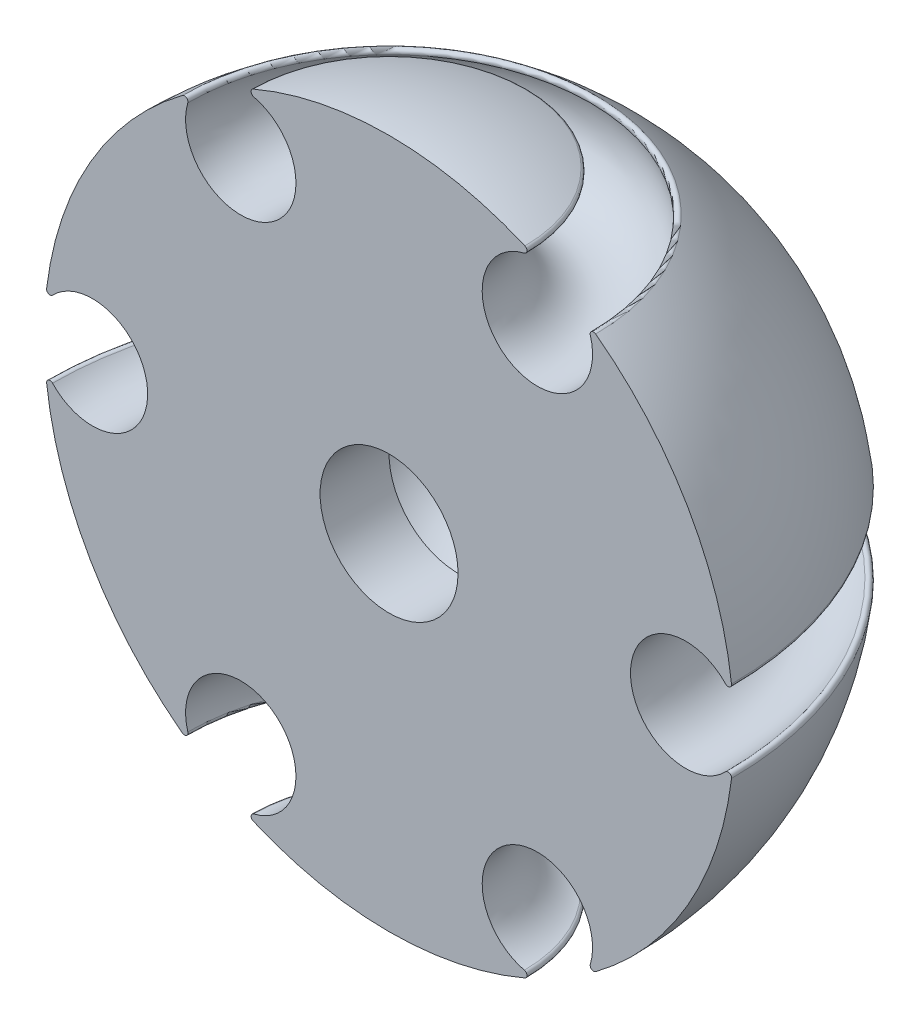
ISO-10303-21;
HEADER;
FILE_DESCRIPTION(('STEP AP214'),'2;1');
FILE_NAME('part.step','',(''),(''),'','','');
FILE_SCHEMA(('AUTOMOTIVE_DESIGN { 1 0 10303 214 1 1 1 1 }'));
ENDSEC;
DATA;
#1=APPLICATION_CONTEXT('core data for automotive mechanical design processes');
#2=APPLICATION_PROTOCOL_DEFINITION('international standard','automotive_design',2000,#1);
#3=PRODUCT_CONTEXT('',#1,'mechanical');
#4=PRODUCT('Part','Part','',(#3));
#5=PRODUCT_RELATED_PRODUCT_CATEGORY('part','',(#4));
#6=PRODUCT_DEFINITION_FORMATION('','',#4);
#7=PRODUCT_DEFINITION_CONTEXT('part definition',#1,'design');
#8=PRODUCT_DEFINITION('design','',#6,#7);
#9=PRODUCT_DEFINITION_SHAPE('','',#8);
#10=(LENGTH_UNIT() NAMED_UNIT(*) SI_UNIT(.MILLI.,.METRE.));
#11=(NAMED_UNIT(*) PLANE_ANGLE_UNIT() SI_UNIT($,.RADIAN.));
#12=(NAMED_UNIT(*) SI_UNIT($,.STERADIAN.) SOLID_ANGLE_UNIT());
#13=UNCERTAINTY_MEASURE_WITH_UNIT(LENGTH_MEASURE(1.E-05),#10,'distance_accuracy_value','');
#14=(GEOMETRIC_REPRESENTATION_CONTEXT(3) GLOBAL_UNCERTAINTY_ASSIGNED_CONTEXT((#13)) GLOBAL_UNIT_ASSIGNED_CONTEXT((#10,
#11,#12)) REPRESENTATION_CONTEXT('',''));
#15=CARTESIAN_POINT('',(0.,0.,0.));
#16=DIRECTION('',(0.,0.,1.));
#17=DIRECTION('',(1.,0.,0.));
#18=AXIS2_PLACEMENT_3D('',#15,#16,#17);
#19=CARTESIAN_POINT('',(0.,55.8662761887189,0.));
#20=DIRECTION('',(0.,-1.,0.));
#21=DIRECTION('',(0.,0.,-1.));
#22=AXIS2_PLACEMENT_3D('',#19,#20,#21);
#23=TOROIDAL_SURFACE('',#22,49.1511627906978,0.500000000000003);
#24=CARTESIAN_POINT('',(0.,55.9255315037565,0.));
#25=DIRECTION('',(0.,-1.,0.));
#26=DIRECTION('',(0.,0.,-1.));
#27=AXIS2_PLACEMENT_3D('',#24,#25,#26);
#28=CIRCLE('',#27,49.6476391825231);
#29=CARTESIAN_POINT('',(-49.6476391825231,55.9255315037565,3.46687611446793E-13));
#30=VERTEX_POINT('',#29);
#31=CARTESIAN_POINT('',(49.6476391825231,55.9255315037565,0.));
#32=VERTEX_POINT('',#31);
#33=EDGE_CURVE('E11',#30,#32,#28,.T.);
#34=ORIENTED_EDGE('',*,*,#33,.T.);
#35=CARTESIAN_POINT('',(49.1511627906978,55.8662761887189,0.));
#36=DIRECTION('',(0.,0.,1.));
#37=DIRECTION('',(1.,0.,0.));
#38=AXIS2_PLACEMENT_3D('',#35,#36,#37);
#39=CIRCLE('',#38,0.500000000000003);
#40=CARTESIAN_POINT('',(48.7893296853627,55.5212011187942,0.));
#41=VERTEX_POINT('',#40);
#42=EDGE_CURVE('E123',#32,#41,#39,.F.);
#43=ORIENTED_EDGE('',*,*,#42,.T.);
#44=CARTESIAN_POINT('',(0.,55.5212011187942,0.));
#45=DIRECTION('',(0.,-1.,0.));
#46=DIRECTION('',(0.,0.,-1.));
#47=AXIS2_PLACEMENT_3D('',#44,#45,#46);
#48=CIRCLE('',#47,48.7893296853627);
#49=CARTESIAN_POINT('',(-48.7893296853627,55.5212011187942,3.40694068262218E-13));
#50=VERTEX_POINT('',#49);
#51=EDGE_CURVE('E50',#50,#41,#48,.T.);
#52=ORIENTED_EDGE('',*,*,#51,.F.);
#53=CARTESIAN_POINT('',(-49.1511627906978,55.8662761887189,3.43220735332325E-13));
#54=DIRECTION('',(0.,0.,-1.));
#55=DIRECTION('',(-1.,0.,0.));
#56=AXIS2_PLACEMENT_3D('',#53,#54,#55);
#57=CIRCLE('',#56,0.500000000000003);
#58=EDGE_CURVE('E125',#30,#50,#57,.F.);
#59=ORIENTED_EDGE('',*,*,#58,.F.);
#60=EDGE_LOOP('',(#34,#43,#52,#59));
#61=FACE_BOUND('',#60,.T.);
#62=ADVANCED_FACE('F35',(#61),#23,.T.);
#63=CARTESIAN_POINT('',(0.,49.9999999999996,0.));
#64=DIRECTION('',(0.,-1.,0.));
#65=DIRECTION('',(-1.,0.,0.));
#66=AXIS2_PLACEMENT_3D('',#63,#64,#65);
#67=SPHERICAL_SURFACE('',#66,50.0000000000001);
#68=CARTESIAN_POINT('',(0.,90.0333510181097,0.));
#69=DIRECTION('',(0.,-1.,0.));
#70=DIRECTION('',(0.,0.,-1.));
#71=AXIS2_PLACEMENT_3D('',#68,#69,#70);
#72=CIRCLE('',#71,29.9554804044401);
#73=CARTESIAN_POINT('',(-29.9554804044401,90.0333510181097,2.09178001656368E-13));
#74=VERTEX_POINT('',#73);
#75=CARTESIAN_POINT('',(29.9554804044401,90.0333510181097,0.));
#76=VERTEX_POINT('',#75);
#77=EDGE_CURVE('E43',#74,#76,#72,.T.);
#78=ORIENTED_EDGE('',*,*,#77,.T.);
#79=CARTESIAN_POINT('',(0.,49.9999999999996,0.));
#80=DIRECTION('',(0.,0.,1.));
#81=DIRECTION('',(1.,0.,0.));
#82=AXIS2_PLACEMENT_3D('',#79,#80,#81);
#83=CIRCLE('',#82,50.0000000000001);
#84=EDGE_CURVE('E134',#76,#32,#83,.F.);
#85=ORIENTED_EDGE('',*,*,#84,.T.);
#86=ORIENTED_EDGE('',*,*,#33,.F.);
#87=CARTESIAN_POINT('',(0.,49.9999999999996,0.));
#88=DIRECTION('',(0.,0.,-1.));
#89=DIRECTION('',(-1.,0.,0.));
#90=AXIS2_PLACEMENT_3D('',#87,#88,#89);
#91=CIRCLE('',#90,50.0000000000001);
#92=EDGE_CURVE('E167',#74,#30,#91,.F.);
#93=ORIENTED_EDGE('',*,*,#92,.F.);
#94=EDGE_LOOP('',(#78,#85,#86,#93));
#95=FACE_BOUND('',#94,.T.);
#96=ADVANCED_FACE('F37',(#95),#67,.T.);
#97=CARTESIAN_POINT('',(0.,89.6330175079286,0.));
#98=DIRECTION('',(0.,-1.,0.));
#99=DIRECTION('',(0.,0.,-1.));
#100=AXIS2_PLACEMENT_3D('',#97,#98,#99);
#101=TOROIDAL_SURFACE('',#100,29.6559256003957,0.499999999999997);
#102=CARTESIAN_POINT('',(0.,89.4921983817405,0.));
#103=DIRECTION('',(0.,-1.,0.));
#104=DIRECTION('',(0.,0.,-1.));
#105=AXIS2_PLACEMENT_3D('',#102,#103,#104);
#106=CIRCLE('',#105,29.1761652709607);
#107=CARTESIAN_POINT('',(-29.1761652709607,89.4921983817405,2.03736073165125E-13));
#108=VERTEX_POINT('',#107);
#109=CARTESIAN_POINT('',(29.1761652709607,89.4921983817405,0.));
#110=VERTEX_POINT('',#109);
#111=EDGE_CURVE('E218',#108,#110,#106,.T.);
#112=ORIENTED_EDGE('',*,*,#111,.T.);
#113=CARTESIAN_POINT('',(29.6559256003957,89.6330175079286,0.));
#114=DIRECTION('',(0.,0.,1.));
#115=DIRECTION('',(1.,0.,0.));
#116=AXIS2_PLACEMENT_3D('',#113,#114,#115);
#117=CIRCLE('',#116,0.499999999999997);
#118=EDGE_CURVE('E140',#76,#110,#117,.T.);
#119=ORIENTED_EDGE('',*,*,#118,.F.);
#120=ORIENTED_EDGE('',*,*,#77,.F.);
#121=CARTESIAN_POINT('',(-29.6559256003957,89.6330175079286,2.07086221639804E-13));
#122=DIRECTION('',(0.,0.,-1.));
#123=DIRECTION('',(-1.,0.,0.));
#124=AXIS2_PLACEMENT_3D('',#121,#122,#123);
#125=CIRCLE('',#124,0.499999999999997);
#126=EDGE_CURVE('E169',#74,#108,#125,.T.);
#127=ORIENTED_EDGE('',*,*,#126,.T.);
#128=EDGE_LOOP('',(#112,#119,#120,#127));
#129=FACE_BOUND('',#128,.T.);
#130=ADVANCED_FACE('F220',(#129),#101,.T.);
#131=CARTESIAN_POINT('',(0.,87.2390923627304,0.));
#132=DIRECTION('',(0.,-1.,0.));
#133=DIRECTION('',(0.,0.,-1.));
#134=AXIS2_PLACEMENT_3D('',#131,#132,#133);
#135=TOROIDAL_SURFACE('',#134,21.5000000000002,8.);
#136=CARTESIAN_POINT('',(0.,95.0133995005351,0.));
#137=DIRECTION('',(0.,-1.,0.));
#138=DIRECTION('',(0.,0.,-1.));
#139=AXIS2_PLACEMENT_3D('',#136,#137,#138);
#140=CIRCLE('',#139,19.6131644144023);
#141=CARTESIAN_POINT('',(-19.6131644144023,95.0133995005351,1.36957995097096E-13));
#142=VERTEX_POINT('',#141);
#143=CARTESIAN_POINT('',(19.6131644144023,95.0133995005351,0.));
#144=VERTEX_POINT('',#143);
#145=EDGE_CURVE('E216',#142,#144,#140,.T.);
#146=ORIENTED_EDGE('',*,*,#145,.T.);
#147=CARTESIAN_POINT('',(21.5000000000002,87.2390923627304,0.));
#148=DIRECTION('',(0.,0.,1.));
#149=DIRECTION('',(1.,0.,0.));
#150=AXIS2_PLACEMENT_3D('',#147,#148,#149);
#151=CIRCLE('',#150,8.);
#152=EDGE_CURVE('E142',#144,#110,#151,.T.);
#153=ORIENTED_EDGE('',*,*,#152,.T.);
#154=ORIENTED_EDGE('',*,*,#111,.F.);
#155=CARTESIAN_POINT('',(-21.5000000000002,87.2390923627304,1.50133697570256E-13));
#156=DIRECTION('',(0.,0.,-1.));
#157=DIRECTION('',(-1.,0.,0.));
#158=AXIS2_PLACEMENT_3D('',#155,#156,#157);
#159=CIRCLE('',#158,8.);
#160=EDGE_CURVE('E172',#142,#108,#159,.T.);
#161=ORIENTED_EDGE('',*,*,#160,.F.);
#162=EDGE_LOOP('',(#146,#153,#154,#161));
#163=FACE_BOUND('',#162,.T.);
#164=ADVANCED_FACE('F226',(#163),#135,.F.);
#165=CARTESIAN_POINT('',(0.,95.4992936966479,0.));
#166=DIRECTION('',(0.,-1.,0.));
#167=DIRECTION('',(0.,0.,-1.));
#168=AXIS2_PLACEMENT_3D('',#165,#166,#167);
#169=TOROIDAL_SURFACE('',#168,19.4952371903025,0.500000000000012);
#170=CARTESIAN_POINT('',(0.,95.9588825218666,0.));
#171=DIRECTION('',(0.,-1.,0.));
#172=DIRECTION('',(0.,0.,-1.));
#173=AXIS2_PLACEMENT_3D('',#170,#171,#172);
#174=CIRCLE('',#173,19.6921587780833);
#175=CARTESIAN_POINT('',(-19.6921587780833,95.9588825218666,1.37509609790428E-13));
#176=VERTEX_POINT('',#175);
#177=CARTESIAN_POINT('',(19.6921587780833,95.9588825218666,0.));
#178=VERTEX_POINT('',#177);
#179=EDGE_CURVE('E213',#176,#178,#174,.T.);
#180=ORIENTED_EDGE('',*,*,#179,.T.);
#181=CARTESIAN_POINT('',(19.4952371903025,95.4992936966479,0.));
#182=DIRECTION('',(0.,0.,1.));
#183=DIRECTION('',(1.,0.,0.));
#184=AXIS2_PLACEMENT_3D('',#181,#182,#183);
#185=CIRCLE('',#184,0.500000000000012);
#186=EDGE_CURVE('E148',#178,#144,#185,.F.);
#187=ORIENTED_EDGE('',*,*,#186,.T.);
#188=ORIENTED_EDGE('',*,*,#145,.F.);
#189=CARTESIAN_POINT('',(-19.4952371903025,95.4992936966479,1.36134513692523E-13));
#190=DIRECTION('',(0.,0.,-1.));
#191=DIRECTION('',(-1.,0.,0.));
#192=AXIS2_PLACEMENT_3D('',#189,#190,#191);
#193=CIRCLE('',#192,0.500000000000012);
#194=EDGE_CURVE('E175',#176,#142,#193,.F.);
#195=ORIENTED_EDGE('',*,*,#194,.F.);
#196=EDGE_LOOP('',(#180,#187,#188,#195));
#197=FACE_BOUND('',#196,.T.);
#198=ADVANCED_FACE('F229',(#197),#169,.T.);
#199=CARTESIAN_POINT('',(0.,49.9999999999996,0.));
#200=DIRECTION('',(0.,-1.,0.));
#201=DIRECTION('',(1.,0.,0.));
#202=AXIS2_PLACEMENT_3D('',#199,#200,#201);
#203=SPHERICAL_SURFACE('',#202,50.0000000000001);
#204=CARTESIAN_POINT('',(0.,49.9999999999996,0.));
#205=DIRECTION('',(0.,0.,-1.));
#206=DIRECTION('',(-1.,0.,0.));
#207=AXIS2_PLACEMENT_3D('',#204,#205,#206);
#208=CIRCLE('',#207,50.0000000000001);
#209=EDGE_CURVE('E178',#178,#176,#208,.F.);
#210=ORIENTED_EDGE('',*,*,#209,.F.);
#211=ORIENTED_EDGE('',*,*,#179,.F.);
#212=EDGE_LOOP('',(#210,#211));
#213=FACE_BOUND('',#212,.T.);
#214=ADVANCED_FACE('F231',(#213),#203,.T.);
#215=CARTESIAN_POINT('',(0.,49.9999999999996,0.));
#216=DIRECTION('',(0.,-1.,0.));
#217=DIRECTION('',(-1.,0.,0.));
#218=AXIS2_PLACEMENT_3D('',#215,#216,#217);
#219=SPHERICAL_SURFACE('',#218,49.9999999999999);
#220=CARTESIAN_POINT('',(0.,4.04111747813278,0.));
#221=DIRECTION('',(0.,-1.,0.));
#222=DIRECTION('',(0.,0.,-1.));
#223=AXIS2_PLACEMENT_3D('',#220,#221,#222);
#224=CIRCLE('',#223,19.6921587780829);
#225=CARTESIAN_POINT('',(-19.6921587780829,4.04111747813278,1.37509609790425E-13));
#226=VERTEX_POINT('',#225);
#227=CARTESIAN_POINT('',(19.6921587780829,4.04111747813278,0.));
#228=VERTEX_POINT('',#227);
#229=EDGE_CURVE('E210',#226,#228,#224,.T.);
#230=ORIENTED_EDGE('',*,*,#229,.T.);
#231=CARTESIAN_POINT('',(0.,49.9999999999996,0.));
#232=DIRECTION('',(0.,0.,-1.));
#233=DIRECTION('',(-1.,0.,0.));
#234=AXIS2_PLACEMENT_3D('',#231,#232,#233);
#235=CIRCLE('',#234,49.9999999999999);
#236=EDGE_CURVE('E181',#226,#228,#235,.F.);
#237=ORIENTED_EDGE('',*,*,#236,.F.);
#238=EDGE_LOOP('',(#230,#237));
#239=FACE_BOUND('',#238,.T.);
#240=ADVANCED_FACE('F233',(#239),#219,.T.);
#241=CARTESIAN_POINT('',(0.,4.50070630335121,0.));
#242=DIRECTION('',(0.,-1.,0.));
#243=DIRECTION('',(0.,0.,-1.));
#244=AXIS2_PLACEMENT_3D('',#241,#242,#243);
#245=TOROIDAL_SURFACE('',#244,19.4952371903022,0.499999999999999);
#246=CARTESIAN_POINT('',(0.,4.986600499464,0.));
#247=DIRECTION('',(0.,-1.,0.));
#248=DIRECTION('',(0.,0.,-1.));
#249=AXIS2_PLACEMENT_3D('',#246,#247,#248);
#250=CIRCLE('',#249,19.613164414402);
#251=CARTESIAN_POINT('',(-19.613164414402,4.986600499464,1.36957995097094E-13));
#252=VERTEX_POINT('',#251);
#253=CARTESIAN_POINT('',(19.613164414402,4.986600499464,0.));
#254=VERTEX_POINT('',#253);
#255=EDGE_CURVE('E208',#252,#254,#250,.T.);
#256=ORIENTED_EDGE('',*,*,#255,.T.);
#257=CARTESIAN_POINT('',(19.4952371903022,4.50070630335121,0.));
#258=DIRECTION('',(0.,0.,1.));
#259=DIRECTION('',(1.,0.,0.));
#260=AXIS2_PLACEMENT_3D('',#257,#258,#259);
#261=CIRCLE('',#260,0.499999999999999);
#262=EDGE_CURVE('E151',#228,#254,#261,.T.);
#263=ORIENTED_EDGE('',*,*,#262,.F.);
#264=ORIENTED_EDGE('',*,*,#229,.F.);
#265=CARTESIAN_POINT('',(-19.4952371903022,4.50070630335121,1.36134513692521E-13));
#266=DIRECTION('',(0.,0.,-1.));
#267=DIRECTION('',(-1.,0.,0.));
#268=AXIS2_PLACEMENT_3D('',#265,#266,#267);
#269=CIRCLE('',#268,0.499999999999999);
#270=EDGE_CURVE('E183',#226,#252,#269,.T.);
#271=ORIENTED_EDGE('',*,*,#270,.T.);
#272=EDGE_LOOP('',(#256,#263,#264,#271));
#273=FACE_BOUND('',#272,.T.);
#274=ADVANCED_FACE('F239',(#273),#245,.T.);
#275=CARTESIAN_POINT('',(0.,12.7609076372687,0.));
#276=DIRECTION('',(0.,-1.,0.));
#277=DIRECTION('',(0.,0.,-1.));
#278=AXIS2_PLACEMENT_3D('',#275,#276,#277);
#279=TOROIDAL_SURFACE('',#278,21.4999999999999,8.);
#280=CARTESIAN_POINT('',(0.,10.5078016182586,0.));
#281=DIRECTION('',(0.,-1.,0.));
#282=DIRECTION('',(0.,0.,-1.));
#283=AXIS2_PLACEMENT_3D('',#280,#281,#282);
#284=CIRCLE('',#283,29.1761652709604);
#285=CARTESIAN_POINT('',(-29.1761652709604,10.5078016182586,2.03736073165123E-13));
#286=VERTEX_POINT('',#285);
#287=CARTESIAN_POINT('',(29.1761652709604,10.5078016182586,0.));
#288=VERTEX_POINT('',#287);
#289=EDGE_CURVE('E206',#286,#288,#284,.T.);
#290=ORIENTED_EDGE('',*,*,#289,.T.);
#291=CARTESIAN_POINT('',(21.4999999999999,12.7609076372687,0.));
#292=DIRECTION('',(0.,0.,1.));
#293=DIRECTION('',(1.,0.,0.));
#294=AXIS2_PLACEMENT_3D('',#291,#292,#293);
#295=CIRCLE('',#294,8.);
#296=EDGE_CURVE('E154',#288,#254,#295,.T.);
#297=ORIENTED_EDGE('',*,*,#296,.T.);
#298=ORIENTED_EDGE('',*,*,#255,.F.);
#299=CARTESIAN_POINT('',(-21.4999999999999,12.7609076372687,1.50133697570254E-13));
#300=DIRECTION('',(0.,0.,-1.));
#301=DIRECTION('',(-1.,0.,0.));
#302=AXIS2_PLACEMENT_3D('',#299,#300,#301);
#303=CIRCLE('',#302,8.);
#304=EDGE_CURVE('E186',#286,#252,#303,.T.);
#305=ORIENTED_EDGE('',*,*,#304,.F.);
#306=EDGE_LOOP('',(#290,#297,#298,#305));
#307=FACE_BOUND('',#306,.T.);
#308=ADVANCED_FACE('F265',(#307),#279,.F.);
#309=CARTESIAN_POINT('',(0.,10.3669824920704,0.));
#310=DIRECTION('',(0.,-1.,0.));
#311=DIRECTION('',(0.,0.,-1.));
#312=AXIS2_PLACEMENT_3D('',#309,#310,#311);
#313=TOROIDAL_SURFACE('',#312,29.6559256003954,0.499999999999999);
#314=CARTESIAN_POINT('',(0.,9.96664898188933,0.));
#315=DIRECTION('',(0.,-1.,0.));
#316=DIRECTION('',(0.,0.,-1.));
#317=AXIS2_PLACEMENT_3D('',#314,#315,#316);
#318=CIRCLE('',#317,29.9554804044398);
#319=CARTESIAN_POINT('',(-29.9554804044398,9.96664898188933,2.09178001656366E-13));
#320=VERTEX_POINT('',#319);
#321=CARTESIAN_POINT('',(29.9554804044398,9.96664898188933,0.));
#322=VERTEX_POINT('',#321);
#323=EDGE_CURVE('E204',#320,#322,#318,.T.);
#324=ORIENTED_EDGE('',*,*,#323,.T.);
#325=CARTESIAN_POINT('',(29.6559256003954,10.3669824920704,0.));
#326=DIRECTION('',(0.,0.,1.));
#327=DIRECTION('',(1.,0.,0.));
#328=AXIS2_PLACEMENT_3D('',#325,#326,#327);
#329=CIRCLE('',#328,0.499999999999999);
#330=EDGE_CURVE('E157',#322,#288,#329,.F.);
#331=ORIENTED_EDGE('',*,*,#330,.T.);
#332=ORIENTED_EDGE('',*,*,#289,.F.);
#333=CARTESIAN_POINT('',(-29.6559256003954,10.3669824920704,2.07086221639802E-13));
#334=DIRECTION('',(0.,0.,-1.));
#335=DIRECTION('',(-1.,0.,0.));
#336=AXIS2_PLACEMENT_3D('',#333,#334,#335);
#337=CIRCLE('',#336,0.499999999999999);
#338=EDGE_CURVE('E189',#320,#286,#337,.F.);
#339=ORIENTED_EDGE('',*,*,#338,.F.);
#340=EDGE_LOOP('',(#324,#331,#332,#339));
#341=FACE_BOUND('',#340,.T.);
#342=ADVANCED_FACE('F261',(#341),#313,.T.);
#343=CARTESIAN_POINT('',(0.,49.9999999999996,0.));
#344=DIRECTION('',(0.,-1.,0.));
#345=DIRECTION('',(-1.,0.,0.));
#346=AXIS2_PLACEMENT_3D('',#343,#344,#345);
#347=SPHERICAL_SURFACE('',#346,50.0000000000001);
#348=CARTESIAN_POINT('',(0.,44.0744684962428,0.));
#349=DIRECTION('',(0.,-1.,0.));
#350=DIRECTION('',(0.,0.,-1.));
#351=AXIS2_PLACEMENT_3D('',#348,#349,#350);
#352=CIRCLE('',#351,49.6476391825231);
#353=CARTESIAN_POINT('',(-49.6476391825231,44.0744684962428,3.46687611446793E-13));
#354=VERTEX_POINT('',#353);
#355=CARTESIAN_POINT('',(49.6476391825231,44.0744684962428,0.));
#356=VERTEX_POINT('',#355);
#357=EDGE_CURVE('E202',#354,#356,#352,.T.);
#358=ORIENTED_EDGE('',*,*,#357,.T.);
#359=CARTESIAN_POINT('',(0.,49.9999999999996,0.));
#360=DIRECTION('',(0.,0.,1.));
#361=DIRECTION('',(1.,0.,0.));
#362=AXIS2_PLACEMENT_3D('',#359,#360,#361);
#363=CIRCLE('',#362,50.0000000000001);
#364=EDGE_CURVE('E160',#356,#322,#363,.F.);
#365=ORIENTED_EDGE('',*,*,#364,.T.);
#366=ORIENTED_EDGE('',*,*,#323,.F.);
#367=CARTESIAN_POINT('',(0.,49.9999999999996,0.));
#368=DIRECTION('',(0.,0.,-1.));
#369=DIRECTION('',(-1.,0.,0.));
#370=AXIS2_PLACEMENT_3D('',#367,#368,#369);
#371=CIRCLE('',#370,50.0000000000001);
#372=EDGE_CURVE('E192',#354,#320,#371,.F.);
#373=ORIENTED_EDGE('',*,*,#372,.F.);
#374=EDGE_LOOP('',(#358,#365,#366,#373));
#375=FACE_BOUND('',#374,.T.);
#376=ADVANCED_FACE('F257',(#375),#347,.T.);
#377=CARTESIAN_POINT('',(0.,44.1337238112804,0.));
#378=DIRECTION('',(0.,-1.,0.));
#379=DIRECTION('',(0.,0.,-1.));
#380=AXIS2_PLACEMENT_3D('',#377,#378,#379);
#381=TOROIDAL_SURFACE('',#380,49.1511627906978,0.500000000000002);
#382=CARTESIAN_POINT('',(0.,44.478798881205,0.));
#383=DIRECTION('',(0.,-1.,0.));
#384=DIRECTION('',(0.,0.,-1.));
#385=AXIS2_PLACEMENT_3D('',#382,#383,#384);
#386=CIRCLE('',#385,48.7893296853627);
#387=CARTESIAN_POINT('',(-48.7893296853627,44.478798881205,3.40694068262218E-13));
#388=VERTEX_POINT('',#387);
#389=CARTESIAN_POINT('',(48.7893296853627,44.478798881205,0.));
#390=VERTEX_POINT('',#389);
#391=EDGE_CURVE('E58',#388,#390,#386,.T.);
#392=ORIENTED_EDGE('',*,*,#391,.T.);
#393=CARTESIAN_POINT('',(49.1511627906978,44.1337238112804,0.));
#394=DIRECTION('',(0.,0.,1.));
#395=DIRECTION('',(1.,0.,0.));
#396=AXIS2_PLACEMENT_3D('',#393,#394,#395);
#397=CIRCLE('',#396,0.500000000000002);
#398=EDGE_CURVE('E163',#356,#390,#397,.T.);
#399=ORIENTED_EDGE('',*,*,#398,.F.);
#400=ORIENTED_EDGE('',*,*,#357,.F.);
#401=CARTESIAN_POINT('',(-49.1511627906978,44.1337238112804,3.43220735332325E-13));
#402=DIRECTION('',(0.,0.,-1.));
#403=DIRECTION('',(-1.,0.,0.));
#404=AXIS2_PLACEMENT_3D('',#401,#402,#403);
#405=CIRCLE('',#404,0.500000000000002);
#406=EDGE_CURVE('E195',#354,#388,#405,.T.);
#407=ORIENTED_EDGE('',*,*,#406,.T.);
#408=EDGE_LOOP('',(#392,#399,#400,#407));
#409=FACE_BOUND('',#408,.T.);
#410=ADVANCED_FACE('F254',(#409),#381,.T.);
#411=CARTESIAN_POINT('',(0.,49.9999999999996,0.));
#412=DIRECTION('',(0.,-1.,0.));
#413=DIRECTION('',(0.,0.,-1.));
#414=AXIS2_PLACEMENT_3D('',#411,#412,#413);
#415=TOROIDAL_SURFACE('',#414,43.,7.99999999999999);
#416=CARTESIAN_POINT('',(-43.,49.9999999999996,3.00267395140509E-13));
#417=DIRECTION('',(0.,0.,-1.));
#418=DIRECTION('',(-1.,0.,0.));
#419=AXIS2_PLACEMENT_3D('',#416,#417,#418);
#420=CIRCLE('',#419,7.99999999999999);
#421=EDGE_CURVE('E197',#50,#388,#420,.T.);
#422=ORIENTED_EDGE('',*,*,#421,.F.);
#423=ORIENTED_EDGE('',*,*,#51,.T.);
#424=CARTESIAN_POINT('',(43.,49.9999999999996,0.));
#425=DIRECTION('',(0.,0.,1.));
#426=DIRECTION('',(1.,0.,0.));
#427=AXIS2_PLACEMENT_3D('',#424,#425,#426);
#428=CIRCLE('',#427,7.99999999999999);
#429=EDGE_CURVE('E137',#41,#390,#428,.T.);
#430=ORIENTED_EDGE('',*,*,#429,.T.);
#431=ORIENTED_EDGE('',*,*,#391,.F.);
#432=EDGE_LOOP('',(#422,#423,#430,#431));
#433=FACE_BOUND('',#432,.T.);
#434=ADVANCED_FACE('F251',(#433),#415,.F.);
#435=CARTESIAN_POINT('',(0.,0.,0.));
#436=DIRECTION('',(0.,0.,-1.));
#437=DIRECTION('',(-1.,0.,0.));
#438=AXIS2_PLACEMENT_3D('',#435,#436,#437);
#439=PLANE('',#438);
#440=CARTESIAN_POINT('',(0.,50.,0.));
#441=DIRECTION('',(0.,0.,1.));
#442=DIRECTION('',(1.,0.,0.));
#443=AXIS2_PLACEMENT_3D('',#440,#441,#442);
#444=CIRCLE('',#443,10.);
#445=CARTESIAN_POINT('',(10.,50.,0.));
#446=VERTEX_POINT('',#445);
#447=EDGE_CURVE('E138',#446,#446,#444,.T.);
#448=ORIENTED_EDGE('',*,*,#447,.F.);
#449=EDGE_LOOP('',(#448));
#450=FACE_BOUND('',#449,.T.);
#451=ORIENTED_EDGE('',*,*,#58,.T.);
#452=ORIENTED_EDGE('',*,*,#421,.T.);
#453=ORIENTED_EDGE('',*,*,#406,.F.);
#454=ORIENTED_EDGE('',*,*,#372,.T.);
#455=ORIENTED_EDGE('',*,*,#338,.T.);
#456=ORIENTED_EDGE('',*,*,#304,.T.);
#457=ORIENTED_EDGE('',*,*,#270,.F.);
#458=ORIENTED_EDGE('',*,*,#236,.T.);
#459=ORIENTED_EDGE('',*,*,#262,.T.);
#460=ORIENTED_EDGE('',*,*,#296,.F.);
#461=ORIENTED_EDGE('',*,*,#330,.F.);
#462=ORIENTED_EDGE('',*,*,#364,.F.);
#463=ORIENTED_EDGE('',*,*,#398,.T.);
#464=ORIENTED_EDGE('',*,*,#429,.F.);
#465=ORIENTED_EDGE('',*,*,#42,.F.);
#466=ORIENTED_EDGE('',*,*,#84,.F.);
#467=ORIENTED_EDGE('',*,*,#118,.T.);
#468=ORIENTED_EDGE('',*,*,#152,.F.);
#469=ORIENTED_EDGE('',*,*,#186,.F.);
#470=ORIENTED_EDGE('',*,*,#209,.T.);
#471=ORIENTED_EDGE('',*,*,#194,.T.);
#472=ORIENTED_EDGE('',*,*,#160,.T.);
#473=ORIENTED_EDGE('',*,*,#126,.F.);
#474=ORIENTED_EDGE('',*,*,#92,.T.);
#475=EDGE_LOOP('',(#451,#452,#453,#454,#455,#456,#457,#458,#459,#460,#461,#462,#463,#464,#465,
#466,#467,#468,#469,#470,#471,#472,#473,#474));
#476=FACE_BOUND('',#475,.T.);
#477=ADVANCED_FACE('F132',(#450,#476),#439,.F.);
#478=CARTESIAN_POINT('',(0.,50.,-10.));
#479=DIRECTION('',(0.,0.,1.));
#480=DIRECTION('',(1.,0.,0.));
#481=AXIS2_PLACEMENT_3D('',#478,#479,#480);
#482=CYLINDRICAL_SURFACE('',#481,10.);
#483=CARTESIAN_POINT('',(0.,50.,-10.));
#484=DIRECTION('',(0.,0.,1.));
#485=DIRECTION('',(1.,0.,0.));
#486=AXIS2_PLACEMENT_3D('',#483,#484,#485);
#487=CIRCLE('',#486,10.);
#488=CARTESIAN_POINT('',(10.,50.,-10.));
#489=VERTEX_POINT('',#488);
#490=EDGE_CURVE('E403',#489,#489,#487,.F.);
#491=ORIENTED_EDGE('',*,*,#490,.T.);
#492=EDGE_LOOP('',(#491));
#493=FACE_BOUND('',#492,.T.);
#494=ORIENTED_EDGE('',*,*,#447,.T.);
#495=EDGE_LOOP('',(#494));
#496=FACE_BOUND('',#495,.T.);
#497=ADVANCED_FACE('F313',(#493,#496),#482,.F.);
#498=CARTESIAN_POINT('',(0.,50.,-10.));
#499=DIRECTION('',(0.,0.,1.));
#500=DIRECTION('',(1.,0.,0.));
#501=AXIS2_PLACEMENT_3D('',#498,#499,#500);
#502=PLANE('',#501);
#503=CARTESIAN_POINT('',(0.,50.,-10.));
#504=DIRECTION('',(0.,0.,1.));
#505=DIRECTION('',(1.,0.,0.));
#506=AXIS2_PLACEMENT_3D('',#503,#504,#505);
#507=CIRCLE('',#506,15.);
#508=CARTESIAN_POINT('',(15.,50.,-10.));
#509=VERTEX_POINT('',#508);
#510=EDGE_CURVE('E402',#509,#509,#507,.T.);
#511=ORIENTED_EDGE('',*,*,#510,.F.);
#512=EDGE_LOOP('',(#511));
#513=FACE_BOUND('',#512,.T.);
#514=ORIENTED_EDGE('',*,*,#490,.F.);
#515=EDGE_LOOP('',(#514));
#516=FACE_BOUND('',#515,.T.);
#517=ADVANCED_FACE('F320',(#513,#516),#502,.F.);
#518=CARTESIAN_POINT('',(0.,50.,-10.));
#519=DIRECTION('',(0.,0.,1.));
#520=DIRECTION('',(-1.,0.,0.));
#521=AXIS2_PLACEMENT_3D('',#518,#519,#520);
#522=SPHERICAL_SURFACE('',#521,15.);
#523=ORIENTED_EDGE('',*,*,#510,.T.);
#524=EDGE_LOOP('',(#523));
#525=FACE_BOUND('',#524,.T.);
#526=ADVANCED_FACE('F327',(#525),#522,.F.);
#527=CLOSED_SHELL('',(#62,#96,#130,#164,#198,#214,#240,#274,#308,#342,#376,#410,#434,#477,#497,
#517,#526));
#528=MANIFOLD_SOLID_BREP('B2',#527);
#529=ADVANCED_BREP_SHAPE_REPRESENTATION('',(#18,#528),#14);
#530=SHAPE_DEFINITION_REPRESENTATION(#9,#529);
ENDSEC;
END-ISO-10303-21;
